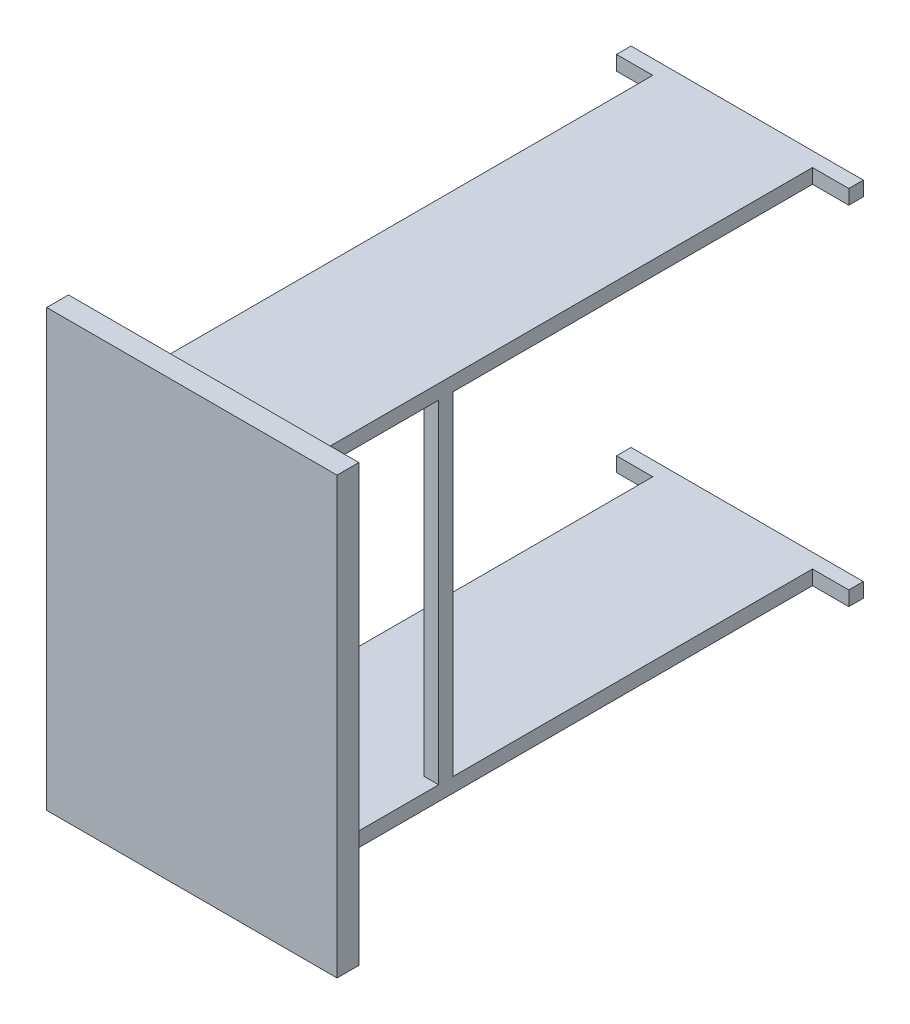
ISO-10303-21;
HEADER;
FILE_DESCRIPTION(('STEP AP214'),'2;1');
FILE_NAME('part.step','',(''),(''),'','','');
FILE_SCHEMA(('AUTOMOTIVE_DESIGN { 1 0 10303 214 1 1 1 1 }'));
ENDSEC;
DATA;
#1=APPLICATION_CONTEXT('core data for automotive mechanical design processes');
#2=APPLICATION_PROTOCOL_DEFINITION('international standard','automotive_design',2000,#1);
#3=PRODUCT_CONTEXT('',#1,'mechanical');
#4=PRODUCT('Part','Part','',(#3));
#5=PRODUCT_RELATED_PRODUCT_CATEGORY('part','',(#4));
#6=PRODUCT_DEFINITION_FORMATION('','',#4);
#7=PRODUCT_DEFINITION_CONTEXT('part definition',#1,'design');
#8=PRODUCT_DEFINITION('design','',#6,#7);
#9=PRODUCT_DEFINITION_SHAPE('','',#8);
#10=(LENGTH_UNIT() NAMED_UNIT(*) SI_UNIT(.MILLI.,.METRE.));
#11=(NAMED_UNIT(*) PLANE_ANGLE_UNIT() SI_UNIT($,.RADIAN.));
#12=(NAMED_UNIT(*) SI_UNIT($,.STERADIAN.) SOLID_ANGLE_UNIT());
#13=UNCERTAINTY_MEASURE_WITH_UNIT(LENGTH_MEASURE(1.E-05),#10,'distance_accuracy_value','');
#14=(GEOMETRIC_REPRESENTATION_CONTEXT(3) GLOBAL_UNCERTAINTY_ASSIGNED_CONTEXT((#13)) GLOBAL_UNIT_ASSIGNED_CONTEXT((#10,
#11,#12)) REPRESENTATION_CONTEXT('',''));
#15=CARTESIAN_POINT('',(0.,0.,0.));
#16=DIRECTION('',(0.,0.,1.));
#17=DIRECTION('',(1.,0.,0.));
#18=AXIS2_PLACEMENT_3D('',#15,#16,#17);
#19=CARTESIAN_POINT('',(160.,229.471728235125,-735.));
#20=DIRECTION('',(0.,1.,0.));
#21=DIRECTION('',(0.,0.,1.));
#22=AXIS2_PLACEMENT_3D('',#19,#20,#21);
#23=PLANE('',#22);
#24=DIRECTION('',(0.,0.,1.));
#25=VECTOR('',#24,1.);
#26=CARTESIAN_POINT('',(90.0000000000001,229.471728235125,-200.));
#27=LINE('',#26,#25);
#28=CARTESIAN_POINT('',(90.,229.471728235125,-220.));
#29=VERTEX_POINT('',#28);
#30=CARTESIAN_POINT('',(90.0000000000001,229.471728235125,-200.));
#31=VERTEX_POINT('',#30);
#32=EDGE_CURVE('E54',#29,#31,#27,.T.);
#33=ORIENTED_EDGE('',*,*,#32,.T.);
#34=DIRECTION('',(1.,0.,0.));
#35=VECTOR('',#34,1.);
#36=CARTESIAN_POINT('',(110.,229.471728235125,-200.));
#37=LINE('',#36,#35);
#38=CARTESIAN_POINT('',(110.,229.471728235125,-200.));
#39=VERTEX_POINT('',#38);
#40=EDGE_CURVE('E284',#31,#39,#37,.T.);
#41=ORIENTED_EDGE('',*,*,#40,.T.);
#42=DIRECTION('',(0.,0.,1.));
#43=VECTOR('',#42,1.);
#44=CARTESIAN_POINT('',(110.,229.471728235125,-735.));
#45=LINE('',#44,#43);
#46=CARTESIAN_POINT('',(110.,229.471728235125,-20.));
#47=VERTEX_POINT('',#46);
#48=EDGE_CURVE('E271',#39,#47,#45,.T.);
#49=ORIENTED_EDGE('',*,*,#48,.T.);
#50=DIRECTION('',(1.,0.,0.));
#51=VECTOR('',#50,1.);
#52=CARTESIAN_POINT('',(160.,229.471728235125,-20.));
#53=LINE('',#52,#51);
#54=CARTESIAN_POINT('',(160.,229.471728235125,-20.));
#55=VERTEX_POINT('',#54);
#56=EDGE_CURVE('E380',#47,#55,#53,.T.);
#57=ORIENTED_EDGE('',*,*,#56,.T.);
#58=DIRECTION('',(0.,0.,1.));
#59=VECTOR('',#58,1.);
#60=CARTESIAN_POINT('',(160.,229.471728235125,-735.));
#61=LINE('',#60,#59);
#62=CARTESIAN_POINT('',(160.,229.471728235125,0.));
#63=VERTEX_POINT('',#62);
#64=EDGE_CURVE('E490',#55,#63,#61,.T.);
#65=ORIENTED_EDGE('',*,*,#64,.T.);
#66=DIRECTION('',(-1.,0.,0.));
#67=VECTOR('',#66,1.);
#68=CARTESIAN_POINT('',(160.,229.471728235125,0.));
#69=LINE('',#68,#67);
#70=CARTESIAN_POINT('',(-160.,229.471728235125,0.));
#71=VERTEX_POINT('',#70);
#72=EDGE_CURVE('E470',#63,#71,#69,.T.);
#73=ORIENTED_EDGE('',*,*,#72,.T.);
#74=DIRECTION('',(0.,0.,1.));
#75=VECTOR('',#74,1.);
#76=CARTESIAN_POINT('',(-160.,229.471728235125,-735.));
#77=LINE('',#76,#75);
#78=CARTESIAN_POINT('',(-160.,229.471728235125,-20.));
#79=VERTEX_POINT('',#78);
#80=EDGE_CURVE('E476',#79,#71,#77,.T.);
#81=ORIENTED_EDGE('',*,*,#80,.F.);
#82=DIRECTION('',(1.,0.,0.));
#83=VECTOR('',#82,1.);
#84=CARTESIAN_POINT('',(160.,229.471728235125,-20.));
#85=LINE('',#84,#83);
#86=CARTESIAN_POINT('',(-110.,229.471728235125,-20.));
#87=VERTEX_POINT('',#86);
#88=EDGE_CURVE('E401',#79,#87,#85,.T.);
#89=ORIENTED_EDGE('',*,*,#88,.T.);
#90=DIRECTION('',(0.,0.,-1.));
#91=VECTOR('',#90,1.);
#92=CARTESIAN_POINT('',(-110.,229.471728235125,-735.));
#93=LINE('',#92,#91);
#94=CARTESIAN_POINT('',(-110.,229.471728235125,-200.));
#95=VERTEX_POINT('',#94);
#96=EDGE_CURVE('E420',#87,#95,#93,.T.);
#97=ORIENTED_EDGE('',*,*,#96,.T.);
#98=DIRECTION('',(-1.,0.,0.));
#99=VECTOR('',#98,1.);
#100=CARTESIAN_POINT('',(-110.,229.471728235125,-200.));
#101=LINE('',#100,#99);
#102=CARTESIAN_POINT('',(-90.,229.471728235125,-200.));
#103=VERTEX_POINT('',#102);
#104=EDGE_CURVE('E313',#103,#95,#101,.T.);
#105=ORIENTED_EDGE('',*,*,#104,.F.);
#106=DIRECTION('',(0.,0.,1.));
#107=VECTOR('',#106,1.);
#108=CARTESIAN_POINT('',(-90.0000000000001,229.471728235125,-200.));
#109=LINE('',#108,#107);
#110=CARTESIAN_POINT('',(-90.,229.471728235125,-220.));
#111=VERTEX_POINT('',#110);
#112=EDGE_CURVE('E304',#111,#103,#109,.T.);
#113=ORIENTED_EDGE('',*,*,#112,.F.);
#114=DIRECTION('',(1.,0.,0.));
#115=VECTOR('',#114,1.);
#116=CARTESIAN_POINT('',(-110.,229.471728235125,-220.));
#117=LINE('',#116,#115);
#118=CARTESIAN_POINT('',(-110.,229.471728235125,-220.));
#119=VERTEX_POINT('',#118);
#120=EDGE_CURVE('E310',#119,#111,#117,.T.);
#121=ORIENTED_EDGE('',*,*,#120,.F.);
#122=CARTESIAN_POINT('',(-110.,229.471728235125,-715.));
#123=VERTEX_POINT('',#122);
#124=EDGE_CURVE('E419',#119,#123,#93,.T.);
#125=ORIENTED_EDGE('',*,*,#124,.T.);
#126=DIRECTION('',(-1.,0.,0.));
#127=VECTOR('',#126,1.);
#128=CARTESIAN_POINT('',(160.,229.471728235125,-715.));
#129=LINE('',#128,#127);
#130=CARTESIAN_POINT('',(-160.,229.471728235125,-715.));
#131=VERTEX_POINT('',#130);
#132=EDGE_CURVE('E409',#123,#131,#129,.T.);
#133=ORIENTED_EDGE('',*,*,#132,.T.);
#134=CARTESIAN_POINT('',(-160.,229.471728235125,-735.));
#135=VERTEX_POINT('',#134);
#136=EDGE_CURVE('E487',#135,#131,#77,.T.);
#137=ORIENTED_EDGE('',*,*,#136,.F.);
#138=DIRECTION('',(-1.,0.,0.));
#139=VECTOR('',#138,1.);
#140=CARTESIAN_POINT('',(160.,229.471728235125,-735.));
#141=LINE('',#140,#139);
#142=CARTESIAN_POINT('',(160.,229.471728235125,-735.));
#143=VERTEX_POINT('',#142);
#144=EDGE_CURVE('E474',#143,#135,#141,.T.);
#145=ORIENTED_EDGE('',*,*,#144,.F.);
#146=CARTESIAN_POINT('',(160.,229.471728235125,-715.));
#147=VERTEX_POINT('',#146);
#148=EDGE_CURVE('E491',#143,#147,#61,.T.);
#149=ORIENTED_EDGE('',*,*,#148,.T.);
#150=DIRECTION('',(-1.,0.,0.));
#151=VECTOR('',#150,1.);
#152=CARTESIAN_POINT('',(160.,229.471728235125,-715.));
#153=LINE('',#152,#151);
#154=CARTESIAN_POINT('',(110.,229.471728235125,-715.));
#155=VERTEX_POINT('',#154);
#156=EDGE_CURVE('E393',#147,#155,#153,.T.);
#157=ORIENTED_EDGE('',*,*,#156,.T.);
#158=CARTESIAN_POINT('',(110.,229.471728235125,-220.));
#159=VERTEX_POINT('',#158);
#160=EDGE_CURVE('E280',#155,#159,#45,.T.);
#161=ORIENTED_EDGE('',*,*,#160,.T.);
#162=DIRECTION('',(-1.,0.,0.));
#163=VECTOR('',#162,1.);
#164=CARTESIAN_POINT('',(110.,229.471728235125,-220.));
#165=LINE('',#164,#163);
#166=EDGE_CURVE('E59',#159,#29,#165,.T.);
#167=ORIENTED_EDGE('',*,*,#166,.T.);
#168=EDGE_LOOP('',(#33,#41,#49,#57,#65,#73,#81,#89,#97,#105,#113,#121,#125,#133,#137,#145,#149,
#157,#161,#167));
#169=FACE_BOUND('',#168,.T.);
#170=ADVANCED_FACE('F39',(#169),#23,.F.);
#171=CARTESIAN_POINT('',(160.,-229.471728235125,-735.));
#172=DIRECTION('',(0.,1.,0.));
#173=DIRECTION('',(0.,0.,1.));
#174=AXIS2_PLACEMENT_3D('',#171,#172,#173);
#175=PLANE('',#174);
#176=DIRECTION('',(-1.,0.,0.));
#177=VECTOR('',#176,1.);
#178=CARTESIAN_POINT('',(110.,-229.471728235125,-200.));
#179=LINE('',#178,#177);
#180=CARTESIAN_POINT('',(110.,-229.471728235125,-200.));
#181=VERTEX_POINT('',#180);
#182=CARTESIAN_POINT('',(90.0000000000001,-229.471728235125,-200.));
#183=VERTEX_POINT('',#182);
#184=EDGE_CURVE('E291',#181,#183,#179,.T.);
#185=ORIENTED_EDGE('',*,*,#184,.T.);
#186=DIRECTION('',(0.,0.,-1.));
#187=VECTOR('',#186,1.);
#188=CARTESIAN_POINT('',(90.0000000000001,-229.471728235125,-200.));
#189=LINE('',#188,#187);
#190=CARTESIAN_POINT('',(90.,-229.471728235125,-220.));
#191=VERTEX_POINT('',#190);
#192=EDGE_CURVE('E301',#183,#191,#189,.T.);
#193=ORIENTED_EDGE('',*,*,#192,.T.);
#194=DIRECTION('',(1.,0.,0.));
#195=VECTOR('',#194,1.);
#196=CARTESIAN_POINT('',(110.,-229.471728235125,-220.));
#197=LINE('',#196,#195);
#198=CARTESIAN_POINT('',(110.,-229.471728235125,-220.));
#199=VERTEX_POINT('',#198);
#200=EDGE_CURVE('E305',#191,#199,#197,.T.);
#201=ORIENTED_EDGE('',*,*,#200,.T.);
#202=DIRECTION('',(0.,0.,1.));
#203=VECTOR('',#202,1.);
#204=CARTESIAN_POINT('',(110.,-229.471728235125,-735.));
#205=LINE('',#204,#203);
#206=CARTESIAN_POINT('',(110.,-229.471728235125,-715.));
#207=VERTEX_POINT('',#206);
#208=EDGE_CURVE('E281',#207,#199,#205,.T.);
#209=ORIENTED_EDGE('',*,*,#208,.F.);
#210=DIRECTION('',(-1.,0.,0.));
#211=VECTOR('',#210,1.);
#212=CARTESIAN_POINT('',(160.,-229.471728235125,-715.));
#213=LINE('',#212,#211);
#214=CARTESIAN_POINT('',(160.,-229.471728235125,-715.));
#215=VERTEX_POINT('',#214);
#216=EDGE_CURVE('E391',#215,#207,#213,.T.);
#217=ORIENTED_EDGE('',*,*,#216,.F.);
#218=DIRECTION('',(0.,0.,1.));
#219=VECTOR('',#218,1.);
#220=CARTESIAN_POINT('',(160.,-229.471728235125,-735.));
#221=LINE('',#220,#219);
#222=CARTESIAN_POINT('',(160.,-229.471728235125,-735.));
#223=VERTEX_POINT('',#222);
#224=EDGE_CURVE('E458',#223,#215,#221,.T.);
#225=ORIENTED_EDGE('',*,*,#224,.F.);
#226=DIRECTION('',(-1.,0.,0.));
#227=VECTOR('',#226,1.);
#228=CARTESIAN_POINT('',(160.,-229.471728235125,-735.));
#229=LINE('',#228,#227);
#230=CARTESIAN_POINT('',(-160.,-229.471728235125,-735.));
#231=VERTEX_POINT('',#230);
#232=EDGE_CURVE('E429',#223,#231,#229,.T.);
#233=ORIENTED_EDGE('',*,*,#232,.T.);
#234=DIRECTION('',(0.,0.,1.));
#235=VECTOR('',#234,1.);
#236=CARTESIAN_POINT('',(-160.,-229.471728235125,-735.));
#237=LINE('',#236,#235);
#238=CARTESIAN_POINT('',(-160.,-229.471728235125,-715.));
#239=VERTEX_POINT('',#238);
#240=EDGE_CURVE('E462',#231,#239,#237,.T.);
#241=ORIENTED_EDGE('',*,*,#240,.T.);
#242=DIRECTION('',(-1.,0.,0.));
#243=VECTOR('',#242,1.);
#244=CARTESIAN_POINT('',(160.,-229.471728235125,-715.));
#245=LINE('',#244,#243);
#246=CARTESIAN_POINT('',(-110.,-229.471728235125,-715.));
#247=VERTEX_POINT('',#246);
#248=EDGE_CURVE('E407',#247,#239,#245,.T.);
#249=ORIENTED_EDGE('',*,*,#248,.F.);
#250=DIRECTION('',(0.,0.,-1.));
#251=VECTOR('',#250,1.);
#252=CARTESIAN_POINT('',(-110.,-229.471728235125,-735.));
#253=LINE('',#252,#251);
#254=CARTESIAN_POINT('',(-110.,-229.471728235125,-220.));
#255=VERTEX_POINT('',#254);
#256=EDGE_CURVE('E415',#255,#247,#253,.T.);
#257=ORIENTED_EDGE('',*,*,#256,.F.);
#258=DIRECTION('',(-1.,0.,0.));
#259=VECTOR('',#258,1.);
#260=CARTESIAN_POINT('',(-110.,-229.471728235125,-220.));
#261=LINE('',#260,#259);
#262=CARTESIAN_POINT('',(-90.,-229.471728235125,-220.));
#263=VERTEX_POINT('',#262);
#264=EDGE_CURVE('E322',#263,#255,#261,.T.);
#265=ORIENTED_EDGE('',*,*,#264,.F.);
#266=DIRECTION('',(0.,0.,-1.));
#267=VECTOR('',#266,1.);
#268=CARTESIAN_POINT('',(-90.0000000000001,-229.471728235125,-200.));
#269=LINE('',#268,#267);
#270=CARTESIAN_POINT('',(-90.0000000000001,-229.471728235125,-200.));
#271=VERTEX_POINT('',#270);
#272=EDGE_CURVE('E334',#271,#263,#269,.T.);
#273=ORIENTED_EDGE('',*,*,#272,.F.);
#274=DIRECTION('',(1.,0.,0.));
#275=VECTOR('',#274,1.);
#276=CARTESIAN_POINT('',(-110.,-229.471728235125,-200.));
#277=LINE('',#276,#275);
#278=CARTESIAN_POINT('',(-110.,-229.471728235125,-200.));
#279=VERTEX_POINT('',#278);
#280=EDGE_CURVE('E333',#279,#271,#277,.T.);
#281=ORIENTED_EDGE('',*,*,#280,.F.);
#282=CARTESIAN_POINT('',(-110.,-229.471728235125,-20.));
#283=VERTEX_POINT('',#282);
#284=EDGE_CURVE('E416',#283,#279,#253,.T.);
#285=ORIENTED_EDGE('',*,*,#284,.F.);
#286=DIRECTION('',(1.,0.,0.));
#287=VECTOR('',#286,1.);
#288=CARTESIAN_POINT('',(160.,-229.471728235125,-20.));
#289=LINE('',#288,#287);
#290=CARTESIAN_POINT('',(-160.,-229.471728235125,-20.));
#291=VERTEX_POINT('',#290);
#292=EDGE_CURVE('E399',#291,#283,#289,.T.);
#293=ORIENTED_EDGE('',*,*,#292,.F.);
#294=CARTESIAN_POINT('',(-160.,-229.471728235125,0.));
#295=VERTEX_POINT('',#294);
#296=EDGE_CURVE('E461',#291,#295,#237,.T.);
#297=ORIENTED_EDGE('',*,*,#296,.T.);
#298=DIRECTION('',(-1.,0.,0.));
#299=VECTOR('',#298,1.);
#300=CARTESIAN_POINT('',(160.,-229.471728235125,0.));
#301=LINE('',#300,#299);
#302=CARTESIAN_POINT('',(160.,-229.471728235125,0.));
#303=VERTEX_POINT('',#302);
#304=EDGE_CURVE('E442',#303,#295,#301,.T.);
#305=ORIENTED_EDGE('',*,*,#304,.F.);
#306=CARTESIAN_POINT('',(160.,-229.471728235125,-20.));
#307=VERTEX_POINT('',#306);
#308=EDGE_CURVE('E457',#307,#303,#221,.T.);
#309=ORIENTED_EDGE('',*,*,#308,.F.);
#310=DIRECTION('',(1.,0.,0.));
#311=VECTOR('',#310,1.);
#312=CARTESIAN_POINT('',(160.,-229.471728235125,-20.));
#313=LINE('',#312,#311);
#314=CARTESIAN_POINT('',(110.,-229.471728235125,-20.));
#315=VERTEX_POINT('',#314);
#316=EDGE_CURVE('E378',#315,#307,#313,.T.);
#317=ORIENTED_EDGE('',*,*,#316,.F.);
#318=EDGE_CURVE('E385',#181,#315,#205,.T.);
#319=ORIENTED_EDGE('',*,*,#318,.F.);
#320=EDGE_LOOP('',(#185,#193,#201,#209,#217,#225,#233,#241,#249,#257,#265,#273,#281,#285,#293,
#297,#305,#309,#317,#319));
#321=FACE_BOUND('',#320,.T.);
#322=ADVANCED_FACE('F555',(#321),#175,.T.);
#323=CARTESIAN_POINT('',(-160.,249.471728235125,-735.));
#324=DIRECTION('',(1.,0.,0.));
#325=DIRECTION('',(0.,0.,-1.));
#326=AXIS2_PLACEMENT_3D('',#323,#324,#325);
#327=PLANE('',#326);
#328=ORIENTED_EDGE('',*,*,#136,.T.);
#329=DIRECTION('',(0.,-1.,0.));
#330=VECTOR('',#329,1.);
#331=CARTESIAN_POINT('',(-160.,300.,-715.));
#332=LINE('',#331,#330);
#333=CARTESIAN_POINT('',(-160.,249.471728235125,-715.));
#334=VERTEX_POINT('',#333);
#335=EDGE_CURVE('E350',#334,#131,#332,.T.);
#336=ORIENTED_EDGE('',*,*,#335,.F.);
#337=DIRECTION('',(0.,0.,1.));
#338=VECTOR('',#337,1.);
#339=CARTESIAN_POINT('',(-160.,249.471728235125,-735.));
#340=LINE('',#339,#338);
#341=CARTESIAN_POINT('',(-160.,249.471728235125,-735.));
#342=VERTEX_POINT('',#341);
#343=EDGE_CURVE('E499',#342,#334,#340,.T.);
#344=ORIENTED_EDGE('',*,*,#343,.F.);
#345=DIRECTION('',(0.,1.,0.));
#346=VECTOR('',#345,1.);
#347=CARTESIAN_POINT('',(-160.,249.471728235125,-735.));
#348=LINE('',#347,#346);
#349=EDGE_CURVE('E466',#135,#342,#348,.T.);
#350=ORIENTED_EDGE('',*,*,#349,.F.);
#351=EDGE_LOOP('',(#328,#336,#344,#350));
#352=FACE_BOUND('',#351,.T.);
#353=ADVANCED_FACE('F560',(#352),#327,.F.);
#354=CARTESIAN_POINT('',(160.,249.471728235125,-735.));
#355=DIRECTION('',(-1.,0.,0.));
#356=DIRECTION('',(0.,0.,1.));
#357=AXIS2_PLACEMENT_3D('',#354,#355,#356);
#358=PLANE('',#357);
#359=DIRECTION('',(0.,0.,1.));
#360=VECTOR('',#359,1.);
#361=CARTESIAN_POINT('',(160.,249.471728235125,-735.));
#362=LINE('',#361,#360);
#363=CARTESIAN_POINT('',(160.,249.471728235125,-735.));
#364=VERTEX_POINT('',#363);
#365=CARTESIAN_POINT('',(160.,249.471728235125,-715.));
#366=VERTEX_POINT('',#365);
#367=EDGE_CURVE('E495',#364,#366,#362,.T.);
#368=ORIENTED_EDGE('',*,*,#367,.T.);
#369=DIRECTION('',(0.,-1.,0.));
#370=VECTOR('',#369,1.);
#371=CARTESIAN_POINT('',(160.,300.,-715.));
#372=LINE('',#371,#370);
#373=EDGE_CURVE('E368',#366,#147,#372,.T.);
#374=ORIENTED_EDGE('',*,*,#373,.T.);
#375=ORIENTED_EDGE('',*,*,#148,.F.);
#376=DIRECTION('',(0.,-1.,0.));
#377=VECTOR('',#376,1.);
#378=CARTESIAN_POINT('',(160.,249.471728235125,-735.));
#379=LINE('',#378,#377);
#380=EDGE_CURVE('E472',#364,#143,#379,.T.);
#381=ORIENTED_EDGE('',*,*,#380,.F.);
#382=EDGE_LOOP('',(#368,#374,#375,#381));
#383=FACE_BOUND('',#382,.T.);
#384=ADVANCED_FACE('F572',(#383),#358,.F.);
#385=CARTESIAN_POINT('',(-160.,-249.471728235125,-735.));
#386=DIRECTION('',(-1.,0.,0.));
#387=DIRECTION('',(0.,0.,1.));
#388=AXIS2_PLACEMENT_3D('',#385,#386,#387);
#389=PLANE('',#388);
#390=CARTESIAN_POINT('',(-160.,-249.471728235125,-715.));
#391=VERTEX_POINT('',#390);
#392=EDGE_CURVE('E351',#239,#391,#332,.T.);
#393=ORIENTED_EDGE('',*,*,#392,.F.);
#394=ORIENTED_EDGE('',*,*,#240,.F.);
#395=DIRECTION('',(0.,-1.,0.));
#396=VECTOR('',#395,1.);
#397=CARTESIAN_POINT('',(-160.,-249.471728235125,-735.));
#398=LINE('',#397,#396);
#399=CARTESIAN_POINT('',(-160.,-249.471728235125,-735.));
#400=VERTEX_POINT('',#399);
#401=EDGE_CURVE('E426',#231,#400,#398,.T.);
#402=ORIENTED_EDGE('',*,*,#401,.T.);
#403=DIRECTION('',(0.,0.,1.));
#404=VECTOR('',#403,1.);
#405=CARTESIAN_POINT('',(-160.,-249.471728235125,-735.));
#406=LINE('',#405,#404);
#407=EDGE_CURVE('E450',#400,#391,#406,.T.);
#408=ORIENTED_EDGE('',*,*,#407,.T.);
#409=EDGE_LOOP('',(#393,#394,#402,#408));
#410=FACE_BOUND('',#409,.T.);
#411=ADVANCED_FACE('F624',(#410),#389,.T.);
#412=CARTESIAN_POINT('',(160.,-249.471728235125,-735.));
#413=DIRECTION('',(1.,0.,0.));
#414=DIRECTION('',(0.,0.,-1.));
#415=AXIS2_PLACEMENT_3D('',#412,#413,#414);
#416=PLANE('',#415);
#417=CARTESIAN_POINT('',(160.,-249.471728235125,-715.));
#418=VERTEX_POINT('',#417);
#419=EDGE_CURVE('E336',#215,#418,#372,.T.);
#420=ORIENTED_EDGE('',*,*,#419,.T.);
#421=DIRECTION('',(0.,0.,1.));
#422=VECTOR('',#421,1.);
#423=CARTESIAN_POINT('',(160.,-249.471728235125,-735.));
#424=LINE('',#423,#422);
#425=CARTESIAN_POINT('',(160.,-249.471728235125,-735.));
#426=VERTEX_POINT('',#425);
#427=EDGE_CURVE('E454',#426,#418,#424,.T.);
#428=ORIENTED_EDGE('',*,*,#427,.F.);
#429=DIRECTION('',(0.,1.,0.));
#430=VECTOR('',#429,1.);
#431=CARTESIAN_POINT('',(160.,-249.471728235125,-735.));
#432=LINE('',#431,#430);
#433=EDGE_CURVE('E433',#426,#223,#432,.T.);
#434=ORIENTED_EDGE('',*,*,#433,.T.);
#435=ORIENTED_EDGE('',*,*,#224,.T.);
#436=EDGE_LOOP('',(#420,#428,#434,#435));
#437=FACE_BOUND('',#436,.T.);
#438=ADVANCED_FACE('F584',(#437),#416,.T.);
#439=CARTESIAN_POINT('',(0.,0.,0.));
#440=DIRECTION('',(0.,0.,1.));
#441=DIRECTION('',(1.,0.,0.));
#442=AXIS2_PLACEMENT_3D('',#439,#440,#441);
#443=PLANE('',#442);
#444=ORIENTED_EDGE('',*,*,#304,.T.);
#445=DIRECTION('',(0.,-1.,0.));
#446=VECTOR('',#445,1.);
#447=CARTESIAN_POINT('',(-160.,-249.471728235125,0.));
#448=LINE('',#447,#446);
#449=CARTESIAN_POINT('',(-160.,-249.471728235125,0.));
#450=VERTEX_POINT('',#449);
#451=EDGE_CURVE('E425',#295,#450,#448,.T.);
#452=ORIENTED_EDGE('',*,*,#451,.T.);
#453=DIRECTION('',(1.,0.,0.));
#454=VECTOR('',#453,1.);
#455=CARTESIAN_POINT('',(160.,-249.471728235125,0.));
#456=LINE('',#455,#454);
#457=CARTESIAN_POINT('',(160.,-249.471728235125,0.));
#458=VERTEX_POINT('',#457);
#459=EDGE_CURVE('E430',#450,#458,#456,.T.);
#460=ORIENTED_EDGE('',*,*,#459,.T.);
#461=DIRECTION('',(0.,1.,0.));
#462=VECTOR('',#461,1.);
#463=CARTESIAN_POINT('',(160.,-249.471728235125,0.));
#464=LINE('',#463,#462);
#465=EDGE_CURVE('E445',#458,#303,#464,.T.);
#466=ORIENTED_EDGE('',*,*,#465,.T.);
#467=EDGE_LOOP('',(#444,#452,#460,#466));
#468=FACE_BOUND('',#467,.T.);
#469=DIRECTION('',(0.,1.,0.));
#470=VECTOR('',#469,1.);
#471=CARTESIAN_POINT('',(200.,300.,0.));
#472=LINE('',#471,#470);
#473=CARTESIAN_POINT('',(200.,-300.,0.));
#474=VERTEX_POINT('',#473);
#475=CARTESIAN_POINT('',(200.,300.,0.));
#476=VERTEX_POINT('',#475);
#477=EDGE_CURVE('E502',#474,#476,#472,.T.);
#478=ORIENTED_EDGE('',*,*,#477,.F.);
#479=DIRECTION('',(1.,0.,0.));
#480=VECTOR('',#479,1.);
#481=CARTESIAN_POINT('',(-200.,-300.,0.));
#482=LINE('',#481,#480);
#483=CARTESIAN_POINT('',(-200.,-300.,0.));
#484=VERTEX_POINT('',#483);
#485=EDGE_CURVE('E507',#484,#474,#482,.T.);
#486=ORIENTED_EDGE('',*,*,#485,.F.);
#487=DIRECTION('',(0.,-1.,0.));
#488=VECTOR('',#487,1.);
#489=CARTESIAN_POINT('',(-200.,300.,0.));
#490=LINE('',#489,#488);
#491=CARTESIAN_POINT('',(-200.,300.,0.));
#492=VERTEX_POINT('',#491);
#493=EDGE_CURVE('E518',#492,#484,#490,.T.);
#494=ORIENTED_EDGE('',*,*,#493,.F.);
#495=DIRECTION('',(-1.,0.,0.));
#496=VECTOR('',#495,1.);
#497=CARTESIAN_POINT('',(-200.,300.,0.));
#498=LINE('',#497,#496);
#499=EDGE_CURVE('E516',#476,#492,#498,.T.);
#500=ORIENTED_EDGE('',*,*,#499,.F.);
#501=EDGE_LOOP('',(#478,#486,#494,#500));
#502=FACE_BOUND('',#501,.T.);
#503=DIRECTION('',(0.,1.,0.));
#504=VECTOR('',#503,1.);
#505=CARTESIAN_POINT('',(-160.,249.471728235125,0.));
#506=LINE('',#505,#504);
#507=CARTESIAN_POINT('',(-160.,249.471728235125,0.));
#508=VERTEX_POINT('',#507);
#509=EDGE_CURVE('E465',#71,#508,#506,.T.);
#510=ORIENTED_EDGE('',*,*,#509,.F.);
#511=ORIENTED_EDGE('',*,*,#72,.F.);
#512=DIRECTION('',(0.,-1.,0.));
#513=VECTOR('',#512,1.);
#514=CARTESIAN_POINT('',(160.,249.471728235125,0.));
#515=LINE('',#514,#513);
#516=CARTESIAN_POINT('',(160.,249.471728235125,0.));
#517=VERTEX_POINT('',#516);
#518=EDGE_CURVE('E482',#517,#63,#515,.T.);
#519=ORIENTED_EDGE('',*,*,#518,.F.);
#520=DIRECTION('',(1.,0.,0.));
#521=VECTOR('',#520,1.);
#522=CARTESIAN_POINT('',(160.,249.471728235125,0.));
#523=LINE('',#522,#521);
#524=EDGE_CURVE('E479',#508,#517,#523,.T.);
#525=ORIENTED_EDGE('',*,*,#524,.F.);
#526=EDGE_LOOP('',(#510,#511,#519,#525));
#527=FACE_BOUND('',#526,.T.);
#528=ADVANCED_FACE('F536',(#468,#502,#527),#443,.F.);
#529=CARTESIAN_POINT('',(200.,300.,30.));
#530=DIRECTION('',(-1.,0.,0.));
#531=DIRECTION('',(0.,-1.,0.));
#532=AXIS2_PLACEMENT_3D('',#529,#530,#531);
#533=PLANE('',#532);
#534=ORIENTED_EDGE('',*,*,#477,.T.);
#535=DIRECTION('',(0.,0.,-1.));
#536=VECTOR('',#535,1.);
#537=CARTESIAN_POINT('',(200.,300.,30.));
#538=LINE('',#537,#536);
#539=CARTESIAN_POINT('',(200.,300.,30.));
#540=VERTEX_POINT('',#539);
#541=EDGE_CURVE('E11',#540,#476,#538,.T.);
#542=ORIENTED_EDGE('',*,*,#541,.F.);
#543=DIRECTION('',(0.,1.,0.));
#544=VECTOR('',#543,1.);
#545=CARTESIAN_POINT('',(200.,300.,30.));
#546=LINE('',#545,#544);
#547=CARTESIAN_POINT('',(200.,-300.,30.));
#548=VERTEX_POINT('',#547);
#549=EDGE_CURVE('E503',#548,#540,#546,.T.);
#550=ORIENTED_EDGE('',*,*,#549,.F.);
#551=DIRECTION('',(0.,0.,-1.));
#552=VECTOR('',#551,1.);
#553=CARTESIAN_POINT('',(200.,-300.,30.));
#554=LINE('',#553,#552);
#555=EDGE_CURVE('E513',#548,#474,#554,.T.);
#556=ORIENTED_EDGE('',*,*,#555,.T.);
#557=EDGE_LOOP('',(#534,#542,#550,#556));
#558=FACE_BOUND('',#557,.T.);
#559=ADVANCED_FACE('F41',(#558),#533,.F.);
#560=CARTESIAN_POINT('',(-200.,300.,30.));
#561=DIRECTION('',(0.,-1.,0.));
#562=DIRECTION('',(0.,0.,-1.));
#563=AXIS2_PLACEMENT_3D('',#560,#561,#562);
#564=PLANE('',#563);
#565=ORIENTED_EDGE('',*,*,#499,.T.);
#566=DIRECTION('',(0.,0.,-1.));
#567=VECTOR('',#566,1.);
#568=CARTESIAN_POINT('',(-200.,300.,30.));
#569=LINE('',#568,#567);
#570=CARTESIAN_POINT('',(-200.,300.,30.));
#571=VERTEX_POINT('',#570);
#572=EDGE_CURVE('E47',#571,#492,#569,.T.);
#573=ORIENTED_EDGE('',*,*,#572,.F.);
#574=DIRECTION('',(-1.,0.,0.));
#575=VECTOR('',#574,1.);
#576=CARTESIAN_POINT('',(-200.,300.,30.));
#577=LINE('',#576,#575);
#578=EDGE_CURVE('E506',#540,#571,#577,.T.);
#579=ORIENTED_EDGE('',*,*,#578,.F.);
#580=ORIENTED_EDGE('',*,*,#541,.T.);
#581=EDGE_LOOP('',(#565,#573,#579,#580));
#582=FACE_BOUND('',#581,.T.);
#583=ADVANCED_FACE('F547',(#582),#564,.F.);
#584=CARTESIAN_POINT('',(-200.,300.,30.));
#585=DIRECTION('',(1.,0.,0.));
#586=DIRECTION('',(0.,1.,0.));
#587=AXIS2_PLACEMENT_3D('',#584,#585,#586);
#588=PLANE('',#587);
#589=ORIENTED_EDGE('',*,*,#493,.T.);
#590=DIRECTION('',(0.,0.,-1.));
#591=VECTOR('',#590,1.);
#592=CARTESIAN_POINT('',(-200.,-300.,30.));
#593=LINE('',#592,#591);
#594=CARTESIAN_POINT('',(-200.,-300.,30.));
#595=VERTEX_POINT('',#594);
#596=EDGE_CURVE('E523',#595,#484,#593,.T.);
#597=ORIENTED_EDGE('',*,*,#596,.F.);
#598=DIRECTION('',(0.,-1.,0.));
#599=VECTOR('',#598,1.);
#600=CARTESIAN_POINT('',(-200.,300.,30.));
#601=LINE('',#600,#599);
#602=EDGE_CURVE('E509',#571,#595,#601,.T.);
#603=ORIENTED_EDGE('',*,*,#602,.F.);
#604=ORIENTED_EDGE('',*,*,#572,.T.);
#605=EDGE_LOOP('',(#589,#597,#603,#604));
#606=FACE_BOUND('',#605,.T.);
#607=ADVANCED_FACE('F530',(#606),#588,.F.);
#608=CARTESIAN_POINT('',(-200.,-300.,30.));
#609=DIRECTION('',(0.,1.,0.));
#610=DIRECTION('',(0.,0.,1.));
#611=AXIS2_PLACEMENT_3D('',#608,#609,#610);
#612=PLANE('',#611);
#613=ORIENTED_EDGE('',*,*,#485,.T.);
#614=ORIENTED_EDGE('',*,*,#555,.F.);
#615=DIRECTION('',(1.,0.,0.));
#616=VECTOR('',#615,1.);
#617=CARTESIAN_POINT('',(-200.,-300.,30.));
#618=LINE('',#617,#616);
#619=EDGE_CURVE('E511',#595,#548,#618,.T.);
#620=ORIENTED_EDGE('',*,*,#619,.F.);
#621=ORIENTED_EDGE('',*,*,#596,.T.);
#622=EDGE_LOOP('',(#613,#614,#620,#621));
#623=FACE_BOUND('',#622,.T.);
#624=ADVANCED_FACE('F540',(#623),#612,.F.);
#625=CARTESIAN_POINT('',(0.,0.,30.));
#626=DIRECTION('',(0.,0.,1.));
#627=DIRECTION('',(1.,0.,0.));
#628=AXIS2_PLACEMENT_3D('',#625,#626,#627);
#629=PLANE('',#628);
#630=ORIENTED_EDGE('',*,*,#549,.T.);
#631=ORIENTED_EDGE('',*,*,#578,.T.);
#632=ORIENTED_EDGE('',*,*,#602,.T.);
#633=ORIENTED_EDGE('',*,*,#619,.T.);
#634=EDGE_LOOP('',(#630,#631,#632,#633));
#635=FACE_BOUND('',#634,.T.);
#636=ADVANCED_FACE('F546',(#635),#629,.T.);
#637=CARTESIAN_POINT('',(-160.,249.471728235125,-20.));
#638=VERTEX_POINT('',#637);
#639=EDGE_CURVE('E498',#638,#508,#340,.T.);
#640=ORIENTED_EDGE('',*,*,#639,.F.);
#641=DIRECTION('',(0.,-1.,0.));
#642=VECTOR('',#641,1.);
#643=CARTESIAN_POINT('',(-160.,300.,-20.));
#644=LINE('',#643,#642);
#645=EDGE_CURVE('E353',#638,#79,#644,.T.);
#646=ORIENTED_EDGE('',*,*,#645,.T.);
#647=ORIENTED_EDGE('',*,*,#80,.T.);
#648=ORIENTED_EDGE('',*,*,#509,.T.);
#649=EDGE_LOOP('',(#640,#646,#647,#648));
#650=FACE_BOUND('',#649,.T.);
#651=ADVANCED_FACE('F575',(#650),#327,.F.);
#652=CARTESIAN_POINT('',(160.,249.471728235125,-735.));
#653=DIRECTION('',(0.,-1.,0.));
#654=DIRECTION('',(1.,0.,0.));
#655=AXIS2_PLACEMENT_3D('',#652,#653,#654);
#656=PLANE('',#655);
#657=ORIENTED_EDGE('',*,*,#343,.T.);
#658=DIRECTION('',(1.,0.,0.));
#659=VECTOR('',#658,1.);
#660=CARTESIAN_POINT('',(160.,249.471728235125,-715.));
#661=LINE('',#660,#659);
#662=CARTESIAN_POINT('',(-110.,249.471728235125,-715.));
#663=VERTEX_POINT('',#662);
#664=EDGE_CURVE('E412',#334,#663,#661,.T.);
#665=ORIENTED_EDGE('',*,*,#664,.T.);
#666=DIRECTION('',(0.,0.,1.));
#667=VECTOR('',#666,1.);
#668=CARTESIAN_POINT('',(-110.,249.471728235125,-735.));
#669=LINE('',#668,#667);
#670=CARTESIAN_POINT('',(-110.,249.471728235125,-20.));
#671=VERTEX_POINT('',#670);
#672=EDGE_CURVE('E422',#663,#671,#669,.T.);
#673=ORIENTED_EDGE('',*,*,#672,.T.);
#674=DIRECTION('',(-1.,0.,0.));
#675=VECTOR('',#674,1.);
#676=CARTESIAN_POINT('',(160.,249.471728235125,-20.));
#677=LINE('',#676,#675);
#678=EDGE_CURVE('E404',#671,#638,#677,.T.);
#679=ORIENTED_EDGE('',*,*,#678,.T.);
#680=ORIENTED_EDGE('',*,*,#639,.T.);
#681=ORIENTED_EDGE('',*,*,#524,.T.);
#682=CARTESIAN_POINT('',(160.,249.471728235125,-20.));
#683=VERTEX_POINT('',#682);
#684=EDGE_CURVE('E494',#683,#517,#362,.T.);
#685=ORIENTED_EDGE('',*,*,#684,.F.);
#686=DIRECTION('',(-1.,0.,0.));
#687=VECTOR('',#686,1.);
#688=CARTESIAN_POINT('',(160.,249.471728235125,-20.));
#689=LINE('',#688,#687);
#690=CARTESIAN_POINT('',(110.,249.471728235125,-20.));
#691=VERTEX_POINT('',#690);
#692=EDGE_CURVE('E382',#683,#691,#689,.T.);
#693=ORIENTED_EDGE('',*,*,#692,.T.);
#694=DIRECTION('',(0.,0.,-1.));
#695=VECTOR('',#694,1.);
#696=CARTESIAN_POINT('',(110.,249.471728235125,-735.));
#697=LINE('',#696,#695);
#698=CARTESIAN_POINT('',(110.,249.471728235125,-715.));
#699=VERTEX_POINT('',#698);
#700=EDGE_CURVE('E388',#691,#699,#697,.T.);
#701=ORIENTED_EDGE('',*,*,#700,.T.);
#702=DIRECTION('',(1.,0.,0.));
#703=VECTOR('',#702,1.);
#704=CARTESIAN_POINT('',(160.,249.471728235125,-715.));
#705=LINE('',#704,#703);
#706=EDGE_CURVE('E396',#699,#366,#705,.T.);
#707=ORIENTED_EDGE('',*,*,#706,.T.);
#708=ORIENTED_EDGE('',*,*,#367,.F.);
#709=DIRECTION('',(1.,0.,0.));
#710=VECTOR('',#709,1.);
#711=CARTESIAN_POINT('',(160.,249.471728235125,-735.));
#712=LINE('',#711,#710);
#713=EDGE_CURVE('E469',#342,#364,#712,.T.);
#714=ORIENTED_EDGE('',*,*,#713,.F.);
#715=EDGE_LOOP('',(#657,#665,#673,#679,#680,#681,#685,#693,#701,#707,#708,#714));
#716=FACE_BOUND('',#715,.T.);
#717=ADVANCED_FACE('F570',(#716),#656,.F.);
#718=ORIENTED_EDGE('',*,*,#64,.F.);
#719=DIRECTION('',(0.,-1.,0.));
#720=VECTOR('',#719,1.);
#721=CARTESIAN_POINT('',(160.,300.,-20.));
#722=LINE('',#721,#720);
#723=EDGE_CURVE('E362',#683,#55,#722,.T.);
#724=ORIENTED_EDGE('',*,*,#723,.F.);
#725=ORIENTED_EDGE('',*,*,#684,.T.);
#726=ORIENTED_EDGE('',*,*,#518,.T.);
#727=EDGE_LOOP('',(#718,#724,#725,#726));
#728=FACE_BOUND('',#727,.T.);
#729=ADVANCED_FACE('F567',(#728),#358,.F.);
#730=CARTESIAN_POINT('',(0.,0.,-735.));
#731=DIRECTION('',(0.,0.,-1.));
#732=DIRECTION('',(-1.,0.,0.));
#733=AXIS2_PLACEMENT_3D('',#730,#731,#732);
#734=PLANE('',#733);
#735=ORIENTED_EDGE('',*,*,#349,.T.);
#736=ORIENTED_EDGE('',*,*,#713,.T.);
#737=ORIENTED_EDGE('',*,*,#380,.T.);
#738=ORIENTED_EDGE('',*,*,#144,.T.);
#739=EDGE_LOOP('',(#735,#736,#737,#738));
#740=FACE_BOUND('',#739,.T.);
#741=ADVANCED_FACE('F565',(#740),#734,.T.);
#742=CARTESIAN_POINT('',(-160.,-249.471728235125,-20.));
#743=VERTEX_POINT('',#742);
#744=EDGE_CURVE('E354',#291,#743,#644,.T.);
#745=ORIENTED_EDGE('',*,*,#744,.T.);
#746=EDGE_CURVE('E439',#743,#450,#406,.T.);
#747=ORIENTED_EDGE('',*,*,#746,.T.);
#748=ORIENTED_EDGE('',*,*,#451,.F.);
#749=ORIENTED_EDGE('',*,*,#296,.F.);
#750=EDGE_LOOP('',(#745,#747,#748,#749));
#751=FACE_BOUND('',#750,.T.);
#752=ADVANCED_FACE('F615',(#751),#389,.T.);
#753=CARTESIAN_POINT('',(160.,-249.471728235125,-20.));
#754=VERTEX_POINT('',#753);
#755=EDGE_CURVE('E360',#307,#754,#722,.T.);
#756=ORIENTED_EDGE('',*,*,#755,.F.);
#757=ORIENTED_EDGE('',*,*,#308,.T.);
#758=ORIENTED_EDGE('',*,*,#465,.F.);
#759=EDGE_CURVE('E453',#754,#458,#424,.T.);
#760=ORIENTED_EDGE('',*,*,#759,.F.);
#761=EDGE_LOOP('',(#756,#757,#758,#760));
#762=FACE_BOUND('',#761,.T.);
#763=ADVANCED_FACE('F622',(#762),#416,.T.);
#764=CARTESIAN_POINT('',(160.,-249.471728235125,-735.));
#765=DIRECTION('',(0.,-1.,0.));
#766=DIRECTION('',(1.,0.,0.));
#767=AXIS2_PLACEMENT_3D('',#764,#765,#766);
#768=PLANE('',#767);
#769=DIRECTION('',(1.,0.,0.));
#770=VECTOR('',#769,1.);
#771=CARTESIAN_POINT('',(-160.,-249.471728235125,-715.));
#772=LINE('',#771,#770);
#773=CARTESIAN_POINT('',(-110.,-249.471728235125,-715.));
#774=VERTEX_POINT('',#773);
#775=EDGE_CURVE('E343',#391,#774,#772,.T.);
#776=ORIENTED_EDGE('',*,*,#775,.F.);
#777=ORIENTED_EDGE('',*,*,#407,.F.);
#778=DIRECTION('',(1.,0.,0.));
#779=VECTOR('',#778,1.);
#780=CARTESIAN_POINT('',(160.,-249.471728235125,-735.));
#781=LINE('',#780,#779);
#782=EDGE_CURVE('E436',#400,#426,#781,.T.);
#783=ORIENTED_EDGE('',*,*,#782,.T.);
#784=ORIENTED_EDGE('',*,*,#427,.T.);
#785=DIRECTION('',(1.,0.,0.));
#786=VECTOR('',#785,1.);
#787=CARTESIAN_POINT('',(160.,-249.471728235125,-715.));
#788=LINE('',#787,#786);
#789=CARTESIAN_POINT('',(110.,-249.471728235125,-715.));
#790=VERTEX_POINT('',#789);
#791=EDGE_CURVE('E371',#790,#418,#788,.T.);
#792=ORIENTED_EDGE('',*,*,#791,.F.);
#793=DIRECTION('',(0.,0.,-1.));
#794=VECTOR('',#793,1.);
#795=CARTESIAN_POINT('',(110.,-249.471728235125,-20.));
#796=LINE('',#795,#794);
#797=CARTESIAN_POINT('',(110.,-249.471728235125,-20.));
#798=VERTEX_POINT('',#797);
#799=EDGE_CURVE('E373',#798,#790,#796,.T.);
#800=ORIENTED_EDGE('',*,*,#799,.F.);
#801=DIRECTION('',(-1.,0.,0.));
#802=VECTOR('',#801,1.);
#803=CARTESIAN_POINT('',(160.,-249.471728235125,-20.));
#804=LINE('',#803,#802);
#805=EDGE_CURVE('E341',#754,#798,#804,.T.);
#806=ORIENTED_EDGE('',*,*,#805,.F.);
#807=ORIENTED_EDGE('',*,*,#759,.T.);
#808=ORIENTED_EDGE('',*,*,#459,.F.);
#809=ORIENTED_EDGE('',*,*,#746,.F.);
#810=DIRECTION('',(-1.,0.,0.));
#811=VECTOR('',#810,1.);
#812=CARTESIAN_POINT('',(-160.,-249.471728235125,-20.));
#813=LINE('',#812,#811);
#814=CARTESIAN_POINT('',(-110.,-249.471728235125,-20.));
#815=VERTEX_POINT('',#814);
#816=EDGE_CURVE('E340',#815,#743,#813,.T.);
#817=ORIENTED_EDGE('',*,*,#816,.F.);
#818=DIRECTION('',(0.,0.,1.));
#819=VECTOR('',#818,1.);
#820=CARTESIAN_POINT('',(-110.,-249.471728235125,-20.));
#821=LINE('',#820,#819);
#822=EDGE_CURVE('E338',#774,#815,#821,.T.);
#823=ORIENTED_EDGE('',*,*,#822,.F.);
#824=EDGE_LOOP('',(#776,#777,#783,#784,#792,#800,#806,#807,#808,#809,#817,#823));
#825=FACE_BOUND('',#824,.T.);
#826=ADVANCED_FACE('F630',(#825),#768,.T.);
#827=CARTESIAN_POINT('',(0.,0.,-735.));
#828=DIRECTION('',(0.,0.,-1.));
#829=DIRECTION('',(-1.,0.,0.));
#830=AXIS2_PLACEMENT_3D('',#827,#828,#829);
#831=PLANE('',#830);
#832=ORIENTED_EDGE('',*,*,#401,.F.);
#833=ORIENTED_EDGE('',*,*,#232,.F.);
#834=ORIENTED_EDGE('',*,*,#433,.F.);
#835=ORIENTED_EDGE('',*,*,#782,.F.);
#836=EDGE_LOOP('',(#832,#833,#834,#835));
#837=FACE_BOUND('',#836,.T.);
#838=ADVANCED_FACE('F638',(#837),#831,.T.);
#839=CARTESIAN_POINT('',(160.,300.,-20.));
#840=DIRECTION('',(0.,0.,1.));
#841=DIRECTION('',(1.,0.,0.));
#842=AXIS2_PLACEMENT_3D('',#839,#840,#841);
#843=PLANE('',#842);
#844=ORIENTED_EDGE('',*,*,#316,.T.);
#845=ORIENTED_EDGE('',*,*,#755,.T.);
#846=ORIENTED_EDGE('',*,*,#805,.T.);
#847=DIRECTION('',(0.,-1.,0.));
#848=VECTOR('',#847,1.);
#849=CARTESIAN_POINT('',(110.,300.,-20.));
#850=LINE('',#849,#848);
#851=EDGE_CURVE('E363',#315,#798,#850,.T.);
#852=ORIENTED_EDGE('',*,*,#851,.F.);
#853=EDGE_LOOP('',(#844,#845,#846,#852));
#854=FACE_BOUND('',#853,.T.);
#855=ADVANCED_FACE('F647',(#854),#843,.F.);
#856=CARTESIAN_POINT('',(160.,300.,-715.));
#857=DIRECTION('',(0.,0.,-1.));
#858=DIRECTION('',(-1.,0.,0.));
#859=AXIS2_PLACEMENT_3D('',#856,#857,#858);
#860=PLANE('',#859);
#861=ORIENTED_EDGE('',*,*,#216,.T.);
#862=DIRECTION('',(0.,-1.,0.));
#863=VECTOR('',#862,1.);
#864=CARTESIAN_POINT('',(110.,300.,-715.));
#865=LINE('',#864,#863);
#866=EDGE_CURVE('E366',#207,#790,#865,.T.);
#867=ORIENTED_EDGE('',*,*,#866,.T.);
#868=ORIENTED_EDGE('',*,*,#791,.T.);
#869=ORIENTED_EDGE('',*,*,#419,.F.);
#870=EDGE_LOOP('',(#861,#867,#868,#869));
#871=FACE_BOUND('',#870,.T.);
#872=ADVANCED_FACE('F655',(#871),#860,.F.);
#873=CARTESIAN_POINT('',(-160.,300.,-715.));
#874=DIRECTION('',(0.,0.,-1.));
#875=DIRECTION('',(-1.,0.,0.));
#876=AXIS2_PLACEMENT_3D('',#873,#874,#875);
#877=PLANE('',#876);
#878=ORIENTED_EDGE('',*,*,#248,.T.);
#879=ORIENTED_EDGE('',*,*,#392,.T.);
#880=ORIENTED_EDGE('',*,*,#775,.T.);
#881=DIRECTION('',(0.,-1.,0.));
#882=VECTOR('',#881,1.);
#883=CARTESIAN_POINT('',(-110.,300.,-715.));
#884=LINE('',#883,#882);
#885=EDGE_CURVE('E347',#247,#774,#884,.T.);
#886=ORIENTED_EDGE('',*,*,#885,.F.);
#887=EDGE_LOOP('',(#878,#879,#880,#886));
#888=FACE_BOUND('',#887,.T.);
#889=ADVANCED_FACE('F664',(#888),#877,.F.);
#890=CARTESIAN_POINT('',(-160.,300.,-20.));
#891=DIRECTION('',(0.,0.,1.));
#892=DIRECTION('',(1.,0.,0.));
#893=AXIS2_PLACEMENT_3D('',#890,#891,#892);
#894=PLANE('',#893);
#895=ORIENTED_EDGE('',*,*,#292,.T.);
#896=DIRECTION('',(0.,-1.,0.));
#897=VECTOR('',#896,1.);
#898=CARTESIAN_POINT('',(-110.,300.,-20.));
#899=LINE('',#898,#897);
#900=EDGE_CURVE('E346',#283,#815,#899,.T.);
#901=ORIENTED_EDGE('',*,*,#900,.T.);
#902=ORIENTED_EDGE('',*,*,#816,.T.);
#903=ORIENTED_EDGE('',*,*,#744,.F.);
#904=EDGE_LOOP('',(#895,#901,#902,#903));
#905=FACE_BOUND('',#904,.T.);
#906=ADVANCED_FACE('F673',(#905),#894,.F.);
#907=EDGE_CURVE('E365',#699,#155,#865,.T.);
#908=ORIENTED_EDGE('',*,*,#907,.T.);
#909=ORIENTED_EDGE('',*,*,#156,.F.);
#910=ORIENTED_EDGE('',*,*,#373,.F.);
#911=ORIENTED_EDGE('',*,*,#706,.F.);
#912=EDGE_LOOP('',(#908,#909,#910,#911));
#913=FACE_BOUND('',#912,.T.);
#914=ADVANCED_FACE('F667',(#913),#860,.F.);
#915=CARTESIAN_POINT('',(110.,300.,-20.));
#916=DIRECTION('',(-1.,0.,0.));
#917=DIRECTION('',(0.,0.,1.));
#918=AXIS2_PLACEMENT_3D('',#915,#916,#917);
#919=PLANE('',#918);
#920=EDGE_CURVE('E277',#691,#47,#850,.T.);
#921=ORIENTED_EDGE('',*,*,#920,.T.);
#922=ORIENTED_EDGE('',*,*,#48,.F.);
#923=DIRECTION('',(0.,1.,0.));
#924=VECTOR('',#923,1.);
#925=CARTESIAN_POINT('',(110.,-300.002,-200.));
#926=LINE('',#925,#924);
#927=EDGE_CURVE('E274',#181,#39,#926,.T.);
#928=ORIENTED_EDGE('',*,*,#927,.F.);
#929=ORIENTED_EDGE('',*,*,#318,.T.);
#930=ORIENTED_EDGE('',*,*,#851,.T.);
#931=ORIENTED_EDGE('',*,*,#799,.T.);
#932=ORIENTED_EDGE('',*,*,#866,.F.);
#933=ORIENTED_EDGE('',*,*,#208,.T.);
#934=DIRECTION('',(0.,1.,0.));
#935=VECTOR('',#934,1.);
#936=CARTESIAN_POINT('',(110.,-300.002,-220.));
#937=LINE('',#936,#935);
#938=EDGE_CURVE('E293',#199,#159,#937,.T.);
#939=ORIENTED_EDGE('',*,*,#938,.T.);
#940=ORIENTED_EDGE('',*,*,#160,.F.);
#941=ORIENTED_EDGE('',*,*,#907,.F.);
#942=ORIENTED_EDGE('',*,*,#700,.F.);
#943=EDGE_LOOP('',(#921,#922,#928,#929,#930,#931,#932,#933,#939,#940,#941,#942));
#944=FACE_BOUND('',#943,.T.);
#945=ADVANCED_FACE('F272',(#944),#919,.F.);
#946=ORIENTED_EDGE('',*,*,#723,.T.);
#947=ORIENTED_EDGE('',*,*,#56,.F.);
#948=ORIENTED_EDGE('',*,*,#920,.F.);
#949=ORIENTED_EDGE('',*,*,#692,.F.);
#950=EDGE_LOOP('',(#946,#947,#948,#949));
#951=FACE_BOUND('',#950,.T.);
#952=ADVANCED_FACE('F658',(#951),#843,.F.);
#953=CARTESIAN_POINT('',(-110.,300.,-20.));
#954=DIRECTION('',(1.,0.,0.));
#955=DIRECTION('',(0.,0.,-1.));
#956=AXIS2_PLACEMENT_3D('',#953,#954,#955);
#957=PLANE('',#956);
#958=EDGE_CURVE('E349',#663,#123,#884,.T.);
#959=ORIENTED_EDGE('',*,*,#958,.T.);
#960=ORIENTED_EDGE('',*,*,#124,.F.);
#961=DIRECTION('',(0.,1.,0.));
#962=VECTOR('',#961,1.);
#963=CARTESIAN_POINT('',(-110.,-300.002,-220.));
#964=LINE('',#963,#962);
#965=EDGE_CURVE('E326',#255,#119,#964,.T.);
#966=ORIENTED_EDGE('',*,*,#965,.F.);
#967=ORIENTED_EDGE('',*,*,#256,.T.);
#968=ORIENTED_EDGE('',*,*,#885,.T.);
#969=ORIENTED_EDGE('',*,*,#822,.T.);
#970=ORIENTED_EDGE('',*,*,#900,.F.);
#971=ORIENTED_EDGE('',*,*,#284,.T.);
#972=DIRECTION('',(0.,1.,0.));
#973=VECTOR('',#972,1.);
#974=CARTESIAN_POINT('',(-110.,-300.002,-200.));
#975=LINE('',#974,#973);
#976=EDGE_CURVE('E323',#279,#95,#975,.T.);
#977=ORIENTED_EDGE('',*,*,#976,.T.);
#978=ORIENTED_EDGE('',*,*,#96,.F.);
#979=EDGE_CURVE('E357',#671,#87,#899,.T.);
#980=ORIENTED_EDGE('',*,*,#979,.F.);
#981=ORIENTED_EDGE('',*,*,#672,.F.);
#982=EDGE_LOOP('',(#959,#960,#966,#967,#968,#969,#970,#971,#977,#978,#980,#981));
#983=FACE_BOUND('',#982,.T.);
#984=ADVANCED_FACE('F704',(#983),#957,.F.);
#985=ORIENTED_EDGE('',*,*,#335,.T.);
#986=ORIENTED_EDGE('',*,*,#132,.F.);
#987=ORIENTED_EDGE('',*,*,#958,.F.);
#988=ORIENTED_EDGE('',*,*,#664,.F.);
#989=EDGE_LOOP('',(#985,#986,#987,#988));
#990=FACE_BOUND('',#989,.T.);
#991=ADVANCED_FACE('F676',(#990),#877,.F.);
#992=ORIENTED_EDGE('',*,*,#979,.T.);
#993=ORIENTED_EDGE('',*,*,#88,.F.);
#994=ORIENTED_EDGE('',*,*,#645,.F.);
#995=ORIENTED_EDGE('',*,*,#678,.F.);
#996=EDGE_LOOP('',(#992,#993,#994,#995));
#997=FACE_BOUND('',#996,.T.);
#998=ADVANCED_FACE('F684',(#997),#894,.F.);
#999=CARTESIAN_POINT('',(-90.0000000000001,-300.002,-200.));
#1000=DIRECTION('',(-1.,0.,0.));
#1001=DIRECTION('',(0.,0.,1.));
#1002=AXIS2_PLACEMENT_3D('',#999,#1000,#1001);
#1003=PLANE('',#1002);
#1004=DIRECTION('',(0.,1.,0.));
#1005=VECTOR('',#1004,1.);
#1006=CARTESIAN_POINT('',(-90.0000000000001,-300.002,-200.));
#1007=LINE('',#1006,#1005);
#1008=EDGE_CURVE('E319',#271,#103,#1007,.T.);
#1009=ORIENTED_EDGE('',*,*,#1008,.F.);
#1010=ORIENTED_EDGE('',*,*,#272,.T.);
#1011=DIRECTION('',(0.,1.,0.));
#1012=VECTOR('',#1011,1.);
#1013=CARTESIAN_POINT('',(-90.,-300.002,-220.));
#1014=LINE('',#1013,#1012);
#1015=EDGE_CURVE('E316',#263,#111,#1014,.T.);
#1016=ORIENTED_EDGE('',*,*,#1015,.T.);
#1017=ORIENTED_EDGE('',*,*,#112,.T.);
#1018=EDGE_LOOP('',(#1009,#1010,#1016,#1017));
#1019=FACE_BOUND('',#1018,.T.);
#1020=ADVANCED_FACE('F725',(#1019),#1003,.F.);
#1021=CARTESIAN_POINT('',(-110.,-300.002,-200.));
#1022=DIRECTION('',(0.,0.,-1.));
#1023=DIRECTION('',(-1.,0.,0.));
#1024=AXIS2_PLACEMENT_3D('',#1021,#1022,#1023);
#1025=PLANE('',#1024);
#1026=ORIENTED_EDGE('',*,*,#976,.F.);
#1027=ORIENTED_EDGE('',*,*,#280,.T.);
#1028=ORIENTED_EDGE('',*,*,#1008,.T.);
#1029=ORIENTED_EDGE('',*,*,#104,.T.);
#1030=EDGE_LOOP('',(#1026,#1027,#1028,#1029));
#1031=FACE_BOUND('',#1030,.T.);
#1032=ADVANCED_FACE('F732',(#1031),#1025,.F.);
#1033=CARTESIAN_POINT('',(-110.,-300.002,-220.));
#1034=DIRECTION('',(0.,0.,1.));
#1035=DIRECTION('',(1.,0.,0.));
#1036=AXIS2_PLACEMENT_3D('',#1033,#1034,#1035);
#1037=PLANE('',#1036);
#1038=ORIENTED_EDGE('',*,*,#1015,.F.);
#1039=ORIENTED_EDGE('',*,*,#264,.T.);
#1040=ORIENTED_EDGE('',*,*,#965,.T.);
#1041=ORIENTED_EDGE('',*,*,#120,.T.);
#1042=EDGE_LOOP('',(#1038,#1039,#1040,#1041));
#1043=FACE_BOUND('',#1042,.T.);
#1044=ADVANCED_FACE('F727',(#1043),#1037,.F.);
#1045=CARTESIAN_POINT('',(90.0000000000001,-300.002,-200.));
#1046=DIRECTION('',(-1.,0.,0.));
#1047=DIRECTION('',(0.,0.,1.));
#1048=AXIS2_PLACEMENT_3D('',#1045,#1046,#1047);
#1049=PLANE('',#1048);
#1050=ORIENTED_EDGE('',*,*,#192,.F.);
#1051=DIRECTION('',(0.,1.,0.));
#1052=VECTOR('',#1051,1.);
#1053=CARTESIAN_POINT('',(90.0000000000001,-300.002,-200.));
#1054=LINE('',#1053,#1052);
#1055=EDGE_CURVE('E287',#183,#31,#1054,.T.);
#1056=ORIENTED_EDGE('',*,*,#1055,.T.);
#1057=ORIENTED_EDGE('',*,*,#32,.F.);
#1058=DIRECTION('',(0.,1.,0.));
#1059=VECTOR('',#1058,1.);
#1060=CARTESIAN_POINT('',(90.,-300.002,-220.));
#1061=LINE('',#1060,#1059);
#1062=EDGE_CURVE('E296',#191,#29,#1061,.T.);
#1063=ORIENTED_EDGE('',*,*,#1062,.F.);
#1064=EDGE_LOOP('',(#1050,#1056,#1057,#1063));
#1065=FACE_BOUND('',#1064,.T.);
#1066=ADVANCED_FACE('F748',(#1065),#1049,.T.);
#1067=CARTESIAN_POINT('',(110.,-300.002,-200.));
#1068=DIRECTION('',(0.,0.,1.));
#1069=DIRECTION('',(1.,0.,0.));
#1070=AXIS2_PLACEMENT_3D('',#1067,#1068,#1069);
#1071=PLANE('',#1070);
#1072=ORIENTED_EDGE('',*,*,#184,.F.);
#1073=ORIENTED_EDGE('',*,*,#927,.T.);
#1074=ORIENTED_EDGE('',*,*,#40,.F.);
#1075=ORIENTED_EDGE('',*,*,#1055,.F.);
#1076=EDGE_LOOP('',(#1072,#1073,#1074,#1075));
#1077=FACE_BOUND('',#1076,.T.);
#1078=ADVANCED_FACE('F289',(#1077),#1071,.T.);
#1079=CARTESIAN_POINT('',(110.,-300.002,-220.));
#1080=DIRECTION('',(0.,0.,-1.));
#1081=DIRECTION('',(-1.,0.,0.));
#1082=AXIS2_PLACEMENT_3D('',#1079,#1080,#1081);
#1083=PLANE('',#1082);
#1084=ORIENTED_EDGE('',*,*,#200,.F.);
#1085=ORIENTED_EDGE('',*,*,#1062,.T.);
#1086=ORIENTED_EDGE('',*,*,#166,.F.);
#1087=ORIENTED_EDGE('',*,*,#938,.F.);
#1088=EDGE_LOOP('',(#1084,#1085,#1086,#1087));
#1089=FACE_BOUND('',#1088,.T.);
#1090=ADVANCED_FACE('F735',(#1089),#1083,.T.);
#1091=CLOSED_SHELL('',(#170,#322,#353,#384,#411,#438,#528,#559,#583,#607,#624,#636,#651,#717,
#729,#741,#752,#763,#826,#838,#855,#872,#889,#906,#914,#945,#952,#984,#991,#998,#1020,#1032,
#1044,#1066,#1078,#1090));
#1092=MANIFOLD_SOLID_BREP('B2',#1091);
#1093=ADVANCED_BREP_SHAPE_REPRESENTATION('',(#18,#1092),#14);
#1094=SHAPE_DEFINITION_REPRESENTATION(#9,#1093);
ENDSEC;
END-ISO-10303-21;
